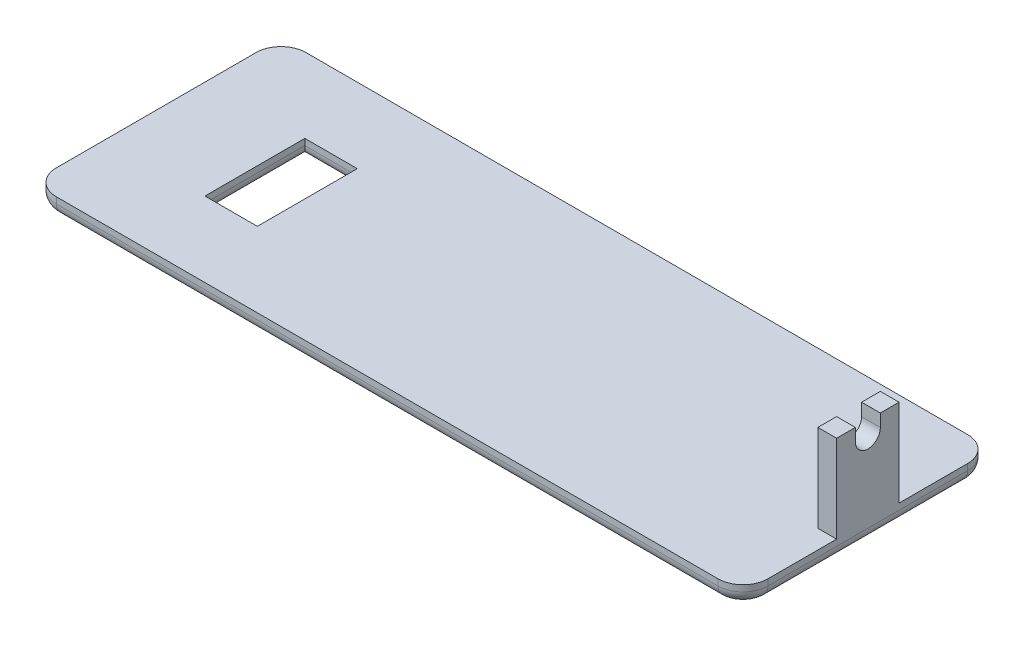
ISO-10303-21;
HEADER;
FILE_DESCRIPTION(('STEP AP214'),'2;1');
FILE_NAME('part.step','',(''),(''),'','','');
FILE_SCHEMA(('AUTOMOTIVE_DESIGN { 1 0 10303 214 1 1 1 1 }'));
ENDSEC;
DATA;
#1=APPLICATION_CONTEXT('core data for automotive mechanical design processes');
#2=APPLICATION_PROTOCOL_DEFINITION('international standard','automotive_design',2000,#1);
#3=PRODUCT_CONTEXT('',#1,'mechanical');
#4=PRODUCT('Part','Part','',(#3));
#5=PRODUCT_RELATED_PRODUCT_CATEGORY('part','',(#4));
#6=PRODUCT_DEFINITION_FORMATION('','',#4);
#7=PRODUCT_DEFINITION_CONTEXT('part definition',#1,'design');
#8=PRODUCT_DEFINITION('design','',#6,#7);
#9=PRODUCT_DEFINITION_SHAPE('','',#8);
#10=(LENGTH_UNIT() NAMED_UNIT(*) SI_UNIT(.MILLI.,.METRE.));
#11=(NAMED_UNIT(*) PLANE_ANGLE_UNIT() SI_UNIT($,.RADIAN.));
#12=(NAMED_UNIT(*) SI_UNIT($,.STERADIAN.) SOLID_ANGLE_UNIT());
#13=UNCERTAINTY_MEASURE_WITH_UNIT(LENGTH_MEASURE(1.E-05),#10,'distance_accuracy_value','');
#14=(GEOMETRIC_REPRESENTATION_CONTEXT(3) GLOBAL_UNCERTAINTY_ASSIGNED_CONTEXT((#13)) GLOBAL_UNIT_ASSIGNED_CONTEXT((#10,
#11,#12)) REPRESENTATION_CONTEXT('',''));
#15=CARTESIAN_POINT('',(0.,0.,0.));
#16=DIRECTION('',(0.,0.,1.));
#17=DIRECTION('',(1.,0.,0.));
#18=AXIS2_PLACEMENT_3D('',#15,#16,#17);
#19=CARTESIAN_POINT('',(0.,21.59,0.));
#20=DIRECTION('',(0.,-1.,0.));
#21=DIRECTION('',(0.,0.,-1.));
#22=AXIS2_PLACEMENT_3D('',#19,#20,#21);
#23=PLANE('',#22);
#24=DIRECTION('',(0.,0.,-1.));
#25=VECTOR('',#24,1.);
#26=CARTESIAN_POINT('',(72.39,21.59,-6.35000000000002));
#27=LINE('',#26,#25);
#28=CARTESIAN_POINT('',(72.39,21.59,6.34999999999998));
#29=VERTEX_POINT('',#28);
#30=CARTESIAN_POINT('',(72.39,21.59,2.54));
#31=VERTEX_POINT('',#30);
#32=EDGE_CURVE('E265',#29,#31,#27,.T.);
#33=ORIENTED_EDGE('',*,*,#32,.T.);
#34=DIRECTION('',(1.,0.,0.));
#35=VECTOR('',#34,1.);
#36=CARTESIAN_POINT('',(-72.391,21.59,2.54));
#37=LINE('',#36,#35);
#38=CARTESIAN_POINT('',(68.58,21.59,2.54));
#39=VERTEX_POINT('',#38);
#40=EDGE_CURVE('E253',#39,#31,#37,.T.);
#41=ORIENTED_EDGE('',*,*,#40,.F.);
#42=DIRECTION('',(0.,0.,1.));
#43=VECTOR('',#42,1.);
#44=CARTESIAN_POINT('',(68.58,21.59,-6.35000000000002));
#45=LINE('',#44,#43);
#46=CARTESIAN_POINT('',(68.58,21.59,6.34999999999998));
#47=VERTEX_POINT('',#46);
#48=EDGE_CURVE('E271',#39,#47,#45,.T.);
#49=ORIENTED_EDGE('',*,*,#48,.T.);
#50=DIRECTION('',(1.,0.,0.));
#51=VECTOR('',#50,1.);
#52=CARTESIAN_POINT('',(72.39,21.59,6.34999999999998));
#53=LINE('',#52,#51);
#54=EDGE_CURVE('E275',#47,#29,#53,.T.);
#55=ORIENTED_EDGE('',*,*,#54,.T.);
#56=EDGE_LOOP('',(#33,#41,#49,#55));
#57=FACE_BOUND('',#56,.T.);
#58=ADVANCED_FACE('F41',(#57),#23,.F.);
#59=CARTESIAN_POINT('',(0.,3.81,0.));
#60=DIRECTION('',(0.,-1.,0.));
#61=DIRECTION('',(0.,0.,-1.));
#62=AXIS2_PLACEMENT_3D('',#59,#60,#61);
#63=PLANE('',#62);
#64=DIRECTION('',(-1.,0.,0.));
#65=VECTOR('',#64,1.);
#66=CARTESIAN_POINT('',(0.,3.81,10.16));
#67=LINE('',#66,#65);
#68=CARTESIAN_POINT('',(-41.642,3.81,10.16));
#69=VERTEX_POINT('',#68);
#70=CARTESIAN_POINT('',(-52.31,3.81,10.16));
#71=VERTEX_POINT('',#70);
#72=EDGE_CURVE('E234',#69,#71,#67,.T.);
#73=ORIENTED_EDGE('',*,*,#72,.T.);
#74=DIRECTION('',(0.,0.,-1.));
#75=VECTOR('',#74,1.);
#76=CARTESIAN_POINT('',(-52.31,3.81,0.));
#77=LINE('',#76,#75);
#78=CARTESIAN_POINT('',(-52.31,3.81,-10.16));
#79=VERTEX_POINT('',#78);
#80=EDGE_CURVE('E227',#71,#79,#77,.T.);
#81=ORIENTED_EDGE('',*,*,#80,.T.);
#82=DIRECTION('',(1.,0.,0.));
#83=VECTOR('',#82,1.);
#84=CARTESIAN_POINT('',(0.,3.81,-10.16));
#85=LINE('',#84,#83);
#86=CARTESIAN_POINT('',(-41.642,3.81,-10.16));
#87=VERTEX_POINT('',#86);
#88=EDGE_CURVE('E215',#79,#87,#85,.T.);
#89=ORIENTED_EDGE('',*,*,#88,.T.);
#90=DIRECTION('',(0.,0.,1.));
#91=VECTOR('',#90,1.);
#92=CARTESIAN_POINT('',(-41.642,3.81,0.));
#93=LINE('',#92,#91);
#94=EDGE_CURVE('E223',#87,#69,#93,.T.);
#95=ORIENTED_EDGE('',*,*,#94,.T.);
#96=EDGE_LOOP('',(#73,#81,#89,#95));
#97=FACE_BOUND('',#96,.T.);
#98=DIRECTION('',(-1.,0.,0.));
#99=VECTOR('',#98,1.);
#100=CARTESIAN_POINT('',(-72.39,3.81,-25.4));
#101=LINE('',#100,#99);
#102=CARTESIAN_POINT('',(67.31,3.81,-25.4));
#103=VERTEX_POINT('',#102);
#104=CARTESIAN_POINT('',(-67.31,3.81,-25.4));
#105=VERTEX_POINT('',#104);
#106=EDGE_CURVE('E300',#103,#105,#101,.T.);
#107=ORIENTED_EDGE('',*,*,#106,.T.);
#108=CARTESIAN_POINT('',(-67.31,3.81,-20.32));
#109=DIRECTION('',(0.,-1.,0.));
#110=DIRECTION('',(0.,0.,-1.));
#111=AXIS2_PLACEMENT_3D('',#108,#109,#110);
#112=CIRCLE('',#111,5.08);
#113=CARTESIAN_POINT('',(-72.39,3.81,-20.32));
#114=VERTEX_POINT('',#113);
#115=EDGE_CURVE('E325',#105,#114,#112,.F.);
#116=ORIENTED_EDGE('',*,*,#115,.T.);
#117=DIRECTION('',(0.,0.,1.));
#118=VECTOR('',#117,1.);
#119=CARTESIAN_POINT('',(-72.39,3.81,25.4));
#120=LINE('',#119,#118);
#121=CARTESIAN_POINT('',(-72.39,3.81,20.32));
#122=VERTEX_POINT('',#121);
#123=EDGE_CURVE('E303',#114,#122,#120,.T.);
#124=ORIENTED_EDGE('',*,*,#123,.T.);
#125=CARTESIAN_POINT('',(-67.31,3.81,20.32));
#126=DIRECTION('',(0.,-1.,0.));
#127=DIRECTION('',(0.,0.,-1.));
#128=AXIS2_PLACEMENT_3D('',#125,#126,#127);
#129=CIRCLE('',#128,5.08);
#130=CARTESIAN_POINT('',(-67.31,3.81,25.4));
#131=VERTEX_POINT('',#130);
#132=EDGE_CURVE('E323',#122,#131,#129,.F.);
#133=ORIENTED_EDGE('',*,*,#132,.T.);
#134=DIRECTION('',(1.,0.,0.));
#135=VECTOR('',#134,1.);
#136=CARTESIAN_POINT('',(-72.39,3.81,25.4));
#137=LINE('',#136,#135);
#138=CARTESIAN_POINT('',(67.31,3.81,25.4));
#139=VERTEX_POINT('',#138);
#140=EDGE_CURVE('E306',#131,#139,#137,.T.);
#141=ORIENTED_EDGE('',*,*,#140,.T.);
#142=CARTESIAN_POINT('',(67.31,3.81,20.32));
#143=DIRECTION('',(0.,-1.,0.));
#144=DIRECTION('',(0.,0.,-1.));
#145=AXIS2_PLACEMENT_3D('',#142,#143,#144);
#146=CIRCLE('',#145,5.08);
#147=CARTESIAN_POINT('',(72.39,3.81,20.32));
#148=VERTEX_POINT('',#147);
#149=EDGE_CURVE('E321',#139,#148,#146,.F.);
#150=ORIENTED_EDGE('',*,*,#149,.T.);
#151=DIRECTION('',(0.,0.,-1.));
#152=VECTOR('',#151,1.);
#153=CARTESIAN_POINT('',(72.39,3.81,25.4));
#154=LINE('',#153,#152);
#155=CARTESIAN_POINT('',(72.39,3.81,6.34999999999998));
#156=VERTEX_POINT('',#155);
#157=EDGE_CURVE('E298',#148,#156,#154,.T.);
#158=ORIENTED_EDGE('',*,*,#157,.T.);
#159=DIRECTION('',(1.,0.,0.));
#160=VECTOR('',#159,1.);
#161=CARTESIAN_POINT('',(72.39,3.81,6.34999999999998));
#162=LINE('',#161,#160);
#163=CARTESIAN_POINT('',(68.58,3.81,6.34999999999998));
#164=VERTEX_POINT('',#163);
#165=EDGE_CURVE('E283',#164,#156,#162,.T.);
#166=ORIENTED_EDGE('',*,*,#165,.F.);
#167=DIRECTION('',(0.,0.,1.));
#168=VECTOR('',#167,1.);
#169=CARTESIAN_POINT('',(68.58,3.81,-6.35000000000002));
#170=LINE('',#169,#168);
#171=CARTESIAN_POINT('',(68.58,3.81,-6.35000000000002));
#172=VERTEX_POINT('',#171);
#173=EDGE_CURVE('E280',#172,#164,#170,.T.);
#174=ORIENTED_EDGE('',*,*,#173,.F.);
#175=DIRECTION('',(-1.,0.,0.));
#176=VECTOR('',#175,1.);
#177=CARTESIAN_POINT('',(72.39,3.81,-6.35000000000002));
#178=LINE('',#177,#176);
#179=CARTESIAN_POINT('',(72.39,3.81,-6.35000000000002));
#180=VERTEX_POINT('',#179);
#181=EDGE_CURVE('E264',#180,#172,#178,.T.);
#182=ORIENTED_EDGE('',*,*,#181,.F.);
#183=CARTESIAN_POINT('',(72.39,3.81,-20.32));
#184=VERTEX_POINT('',#183);
#185=EDGE_CURVE('E297',#180,#184,#154,.T.);
#186=ORIENTED_EDGE('',*,*,#185,.T.);
#187=CARTESIAN_POINT('',(67.31,3.81,-20.32));
#188=DIRECTION('',(0.,-1.,0.));
#189=DIRECTION('',(0.,0.,-1.));
#190=AXIS2_PLACEMENT_3D('',#187,#188,#189);
#191=CIRCLE('',#190,5.08);
#192=EDGE_CURVE('E319',#184,#103,#191,.F.);
#193=ORIENTED_EDGE('',*,*,#192,.T.);
#194=EDGE_LOOP('',(#107,#116,#124,#133,#141,#150,#158,#166,#174,#182,#186,#193));
#195=FACE_BOUND('',#194,.T.);
#196=ADVANCED_FACE('F232',(#97,#195),#63,.F.);
#197=CARTESIAN_POINT('',(72.39,3.81,25.4));
#198=DIRECTION('',(-1.,0.,0.));
#199=DIRECTION('',(0.,0.,1.));
#200=AXIS2_PLACEMENT_3D('',#197,#198,#199);
#201=PLANE('',#200);
#202=DIRECTION('',(0.,-1.,0.));
#203=VECTOR('',#202,1.);
#204=CARTESIAN_POINT('',(72.39,3.81,20.32));
#205=LINE('',#204,#203);
#206=CARTESIAN_POINT('',(72.39,2.54,20.32));
#207=VERTEX_POINT('',#206);
#208=EDGE_CURVE('E334',#148,#207,#205,.T.);
#209=ORIENTED_EDGE('',*,*,#208,.T.);
#210=DIRECTION('',(0.,0.,-1.));
#211=VECTOR('',#210,1.);
#212=CARTESIAN_POINT('',(72.39,2.54,-20.32));
#213=LINE('',#212,#211);
#214=CARTESIAN_POINT('',(72.39,2.54,-20.32));
#215=VERTEX_POINT('',#214);
#216=EDGE_CURVE('E372',#207,#215,#213,.T.);
#217=ORIENTED_EDGE('',*,*,#216,.T.);
#218=DIRECTION('',(0.,-1.,0.));
#219=VECTOR('',#218,1.);
#220=CARTESIAN_POINT('',(72.39,3.81,-20.32));
#221=LINE('',#220,#219);
#222=EDGE_CURVE('E332',#215,#184,#221,.F.);
#223=ORIENTED_EDGE('',*,*,#222,.T.);
#224=ORIENTED_EDGE('',*,*,#185,.F.);
#225=DIRECTION('',(0.,-1.,0.));
#226=VECTOR('',#225,1.);
#227=CARTESIAN_POINT('',(72.39,21.59,-6.35000000000002));
#228=LINE('',#227,#226);
#229=CARTESIAN_POINT('',(72.39,21.59,-6.35000000000002));
#230=VERTEX_POINT('',#229);
#231=EDGE_CURVE('E294',#230,#180,#228,.T.);
#232=ORIENTED_EDGE('',*,*,#231,.F.);
#233=CARTESIAN_POINT('',(72.39,21.59,-2.54));
#234=VERTEX_POINT('',#233);
#235=EDGE_CURVE('E269',#234,#230,#27,.T.);
#236=ORIENTED_EDGE('',*,*,#235,.F.);
#237=DIRECTION('',(0.,1.,0.));
#238=VECTOR('',#237,1.);
#239=CARTESIAN_POINT('',(72.39,21.59,-2.54));
#240=LINE('',#239,#238);
#241=CARTESIAN_POINT('',(72.39,19.05,-2.54));
#242=VERTEX_POINT('',#241);
#243=EDGE_CURVE('E250',#242,#234,#240,.T.);
#244=ORIENTED_EDGE('',*,*,#243,.F.);
#245=CARTESIAN_POINT('',(72.39,19.05,0.));
#246=DIRECTION('',(1.,0.,0.));
#247=DIRECTION('',(0.,0.,1.));
#248=AXIS2_PLACEMENT_3D('',#245,#246,#247);
#249=CIRCLE('',#248,2.54);
#250=CARTESIAN_POINT('',(72.39,19.05,2.54));
#251=VERTEX_POINT('',#250);
#252=EDGE_CURVE('E247',#251,#242,#249,.T.);
#253=ORIENTED_EDGE('',*,*,#252,.F.);
#254=DIRECTION('',(0.,-1.,0.));
#255=VECTOR('',#254,1.);
#256=CARTESIAN_POINT('',(72.39,21.59,2.54));
#257=LINE('',#256,#255);
#258=EDGE_CURVE('E244',#31,#251,#257,.T.);
#259=ORIENTED_EDGE('',*,*,#258,.F.);
#260=ORIENTED_EDGE('',*,*,#32,.F.);
#261=DIRECTION('',(0.,-1.,0.));
#262=VECTOR('',#261,1.);
#263=CARTESIAN_POINT('',(72.39,21.59,6.34999999999998));
#264=LINE('',#263,#262);
#265=EDGE_CURVE('E277',#29,#156,#264,.T.);
#266=ORIENTED_EDGE('',*,*,#265,.T.);
#267=ORIENTED_EDGE('',*,*,#157,.F.);
#268=EDGE_LOOP('',(#209,#217,#223,#224,#232,#236,#244,#253,#259,#260,#266,#267));
#269=FACE_BOUND('',#268,.T.);
#270=ADVANCED_FACE('F459',(#269),#201,.F.);
#271=CARTESIAN_POINT('',(-72.39,3.81,-25.4));
#272=DIRECTION('',(0.,0.,1.));
#273=DIRECTION('',(1.,0.,0.));
#274=AXIS2_PLACEMENT_3D('',#271,#272,#273);
#275=PLANE('',#274);
#276=DIRECTION('',(0.,-1.,0.));
#277=VECTOR('',#276,1.);
#278=CARTESIAN_POINT('',(67.31,3.81,-25.4));
#279=LINE('',#278,#277);
#280=CARTESIAN_POINT('',(67.31,2.54,-25.4));
#281=VERTEX_POINT('',#280);
#282=EDGE_CURVE('E314',#103,#281,#279,.T.);
#283=ORIENTED_EDGE('',*,*,#282,.T.);
#284=DIRECTION('',(-1.,0.,0.));
#285=VECTOR('',#284,1.);
#286=CARTESIAN_POINT('',(-67.31,2.54,-25.4));
#287=LINE('',#286,#285);
#288=CARTESIAN_POINT('',(-67.31,2.54,-25.4));
#289=VERTEX_POINT('',#288);
#290=EDGE_CURVE('E376',#281,#289,#287,.T.);
#291=ORIENTED_EDGE('',*,*,#290,.T.);
#292=DIRECTION('',(0.,-1.,0.));
#293=VECTOR('',#292,1.);
#294=CARTESIAN_POINT('',(-67.31,3.81,-25.4));
#295=LINE('',#294,#293);
#296=EDGE_CURVE('E317',#289,#105,#295,.F.);
#297=ORIENTED_EDGE('',*,*,#296,.T.);
#298=ORIENTED_EDGE('',*,*,#106,.F.);
#299=EDGE_LOOP('',(#283,#291,#297,#298));
#300=FACE_BOUND('',#299,.T.);
#301=ADVANCED_FACE('F518',(#300),#275,.F.);
#302=CARTESIAN_POINT('',(-72.39,3.81,25.4));
#303=DIRECTION('',(1.,0.,0.));
#304=DIRECTION('',(0.,0.,-1.));
#305=AXIS2_PLACEMENT_3D('',#302,#303,#304);
#306=PLANE('',#305);
#307=DIRECTION('',(0.,-1.,0.));
#308=VECTOR('',#307,1.);
#309=CARTESIAN_POINT('',(-72.39,3.81,-20.32));
#310=LINE('',#309,#308);
#311=CARTESIAN_POINT('',(-72.39,2.54,-20.32));
#312=VERTEX_POINT('',#311);
#313=EDGE_CURVE('E311',#114,#312,#310,.T.);
#314=ORIENTED_EDGE('',*,*,#313,.T.);
#315=DIRECTION('',(0.,0.,1.));
#316=VECTOR('',#315,1.);
#317=CARTESIAN_POINT('',(-72.39,2.54,20.32));
#318=LINE('',#317,#316);
#319=CARTESIAN_POINT('',(-72.39,2.54,20.32));
#320=VERTEX_POINT('',#319);
#321=EDGE_CURVE('E337',#312,#320,#318,.T.);
#322=ORIENTED_EDGE('',*,*,#321,.T.);
#323=DIRECTION('',(0.,-1.,0.));
#324=VECTOR('',#323,1.);
#325=CARTESIAN_POINT('',(-72.39,3.81,20.32));
#326=LINE('',#325,#324);
#327=EDGE_CURVE('E309',#320,#122,#326,.F.);
#328=ORIENTED_EDGE('',*,*,#327,.T.);
#329=ORIENTED_EDGE('',*,*,#123,.F.);
#330=EDGE_LOOP('',(#314,#322,#328,#329));
#331=FACE_BOUND('',#330,.T.);
#332=ADVANCED_FACE('F526',(#331),#306,.F.);
#333=CARTESIAN_POINT('',(-72.39,3.81,25.4));
#334=DIRECTION('',(0.,0.,-1.));
#335=DIRECTION('',(-1.,0.,0.));
#336=AXIS2_PLACEMENT_3D('',#333,#334,#335);
#337=PLANE('',#336);
#338=DIRECTION('',(0.,-1.,0.));
#339=VECTOR('',#338,1.);
#340=CARTESIAN_POINT('',(-67.31,3.81,25.4));
#341=LINE('',#340,#339);
#342=CARTESIAN_POINT('',(-67.31,2.54,25.4));
#343=VERTEX_POINT('',#342);
#344=EDGE_CURVE('E329',#131,#343,#341,.T.);
#345=ORIENTED_EDGE('',*,*,#344,.T.);
#346=DIRECTION('',(1.,0.,0.));
#347=VECTOR('',#346,1.);
#348=CARTESIAN_POINT('',(67.31,2.54,25.4));
#349=LINE('',#348,#347);
#350=CARTESIAN_POINT('',(67.31,2.54,25.4));
#351=VERTEX_POINT('',#350);
#352=EDGE_CURVE('E368',#343,#351,#349,.T.);
#353=ORIENTED_EDGE('',*,*,#352,.T.);
#354=DIRECTION('',(0.,-1.,0.));
#355=VECTOR('',#354,1.);
#356=CARTESIAN_POINT('',(67.31,3.81,25.4));
#357=LINE('',#356,#355);
#358=EDGE_CURVE('E327',#351,#139,#357,.F.);
#359=ORIENTED_EDGE('',*,*,#358,.T.);
#360=ORIENTED_EDGE('',*,*,#140,.F.);
#361=EDGE_LOOP('',(#345,#353,#359,#360));
#362=FACE_BOUND('',#361,.T.);
#363=ADVANCED_FACE('F537',(#362),#337,.F.);
#364=CARTESIAN_POINT('',(0.,0.,0.));
#365=DIRECTION('',(0.,-1.,0.));
#366=DIRECTION('',(0.,0.,-1.));
#367=AXIS2_PLACEMENT_3D('',#364,#365,#366);
#368=PLANE('',#367);
#369=DIRECTION('',(0.,0.,-1.));
#370=VECTOR('',#369,1.);
#371=CARTESIAN_POINT('',(-54.85,0.,10.16));
#372=LINE('',#371,#370);
#373=CARTESIAN_POINT('',(-54.85,0.,-12.7));
#374=VERTEX_POINT('',#373);
#375=CARTESIAN_POINT('',(-54.85,0.,12.7));
#376=VERTEX_POINT('',#375);
#377=EDGE_CURVE('E361',#374,#376,#372,.F.);
#378=ORIENTED_EDGE('',*,*,#377,.T.);
#379=DIRECTION('',(-1.,0.,0.));
#380=VECTOR('',#379,1.);
#381=CARTESIAN_POINT('',(-41.642,0.,12.7));
#382=LINE('',#381,#380);
#383=CARTESIAN_POINT('',(-39.102,0.,12.7));
#384=VERTEX_POINT('',#383);
#385=EDGE_CURVE('E363',#376,#384,#382,.F.);
#386=ORIENTED_EDGE('',*,*,#385,.T.);
#387=DIRECTION('',(0.,0.,1.));
#388=VECTOR('',#387,1.);
#389=CARTESIAN_POINT('',(-39.102,0.,-10.16));
#390=LINE('',#389,#388);
#391=CARTESIAN_POINT('',(-39.102,0.,-12.7));
#392=VERTEX_POINT('',#391);
#393=EDGE_CURVE('E357',#384,#392,#390,.F.);
#394=ORIENTED_EDGE('',*,*,#393,.T.);
#395=DIRECTION('',(1.,0.,0.));
#396=VECTOR('',#395,1.);
#397=CARTESIAN_POINT('',(-52.31,0.,-12.7));
#398=LINE('',#397,#396);
#399=EDGE_CURVE('E359',#392,#374,#398,.F.);
#400=ORIENTED_EDGE('',*,*,#399,.T.);
#401=EDGE_LOOP('',(#378,#386,#394,#400));
#402=FACE_BOUND('',#401,.T.);
#403=CARTESIAN_POINT('',(-67.31,0.,20.32));
#404=DIRECTION('',(0.,-1.,0.));
#405=DIRECTION('',(0.,0.,-1.));
#406=AXIS2_PLACEMENT_3D('',#403,#404,#405);
#407=CIRCLE('',#406,2.54);
#408=CARTESIAN_POINT('',(-67.31,0.,22.86));
#409=VERTEX_POINT('',#408);
#410=CARTESIAN_POINT('',(-69.85,0.,20.32));
#411=VERTEX_POINT('',#410);
#412=EDGE_CURVE('E352',#409,#411,#407,.T.);
#413=ORIENTED_EDGE('',*,*,#412,.T.);
#414=DIRECTION('',(0.,0.,1.));
#415=VECTOR('',#414,1.);
#416=CARTESIAN_POINT('',(-69.85,0.,-20.32));
#417=LINE('',#416,#415);
#418=CARTESIAN_POINT('',(-69.85,0.,-20.32));
#419=VERTEX_POINT('',#418);
#420=EDGE_CURVE('E354',#411,#419,#417,.F.);
#421=ORIENTED_EDGE('',*,*,#420,.T.);
#422=CARTESIAN_POINT('',(-67.31,0.,-20.32));
#423=DIRECTION('',(0.,-1.,0.));
#424=DIRECTION('',(0.,0.,-1.));
#425=AXIS2_PLACEMENT_3D('',#422,#423,#424);
#426=CIRCLE('',#425,2.54);
#427=CARTESIAN_POINT('',(-67.31,0.,-22.86));
#428=VERTEX_POINT('',#427);
#429=EDGE_CURVE('E340',#419,#428,#426,.T.);
#430=ORIENTED_EDGE('',*,*,#429,.T.);
#431=DIRECTION('',(-1.,0.,0.));
#432=VECTOR('',#431,1.);
#433=CARTESIAN_POINT('',(67.31,0.,-22.86));
#434=LINE('',#433,#432);
#435=CARTESIAN_POINT('',(67.31,0.,-22.86));
#436=VERTEX_POINT('',#435);
#437=EDGE_CURVE('E342',#428,#436,#434,.F.);
#438=ORIENTED_EDGE('',*,*,#437,.T.);
#439=CARTESIAN_POINT('',(67.31,0.,-20.32));
#440=DIRECTION('',(0.,-1.,0.));
#441=DIRECTION('',(0.,0.,-1.));
#442=AXIS2_PLACEMENT_3D('',#439,#440,#441);
#443=CIRCLE('',#442,2.54);
#444=CARTESIAN_POINT('',(69.85,0.,-20.32));
#445=VERTEX_POINT('',#444);
#446=EDGE_CURVE('E344',#436,#445,#443,.T.);
#447=ORIENTED_EDGE('',*,*,#446,.T.);
#448=DIRECTION('',(0.,0.,-1.));
#449=VECTOR('',#448,1.);
#450=CARTESIAN_POINT('',(69.85,0.,20.32));
#451=LINE('',#450,#449);
#452=CARTESIAN_POINT('',(69.85,0.,20.32));
#453=VERTEX_POINT('',#452);
#454=EDGE_CURVE('E346',#445,#453,#451,.F.);
#455=ORIENTED_EDGE('',*,*,#454,.T.);
#456=CARTESIAN_POINT('',(67.31,0.,20.32));
#457=DIRECTION('',(0.,-1.,0.));
#458=DIRECTION('',(0.,0.,-1.));
#459=AXIS2_PLACEMENT_3D('',#456,#457,#458);
#460=CIRCLE('',#459,2.54);
#461=CARTESIAN_POINT('',(67.31,0.,22.86));
#462=VERTEX_POINT('',#461);
#463=EDGE_CURVE('E348',#453,#462,#460,.T.);
#464=ORIENTED_EDGE('',*,*,#463,.T.);
#465=DIRECTION('',(1.,0.,0.));
#466=VECTOR('',#465,1.);
#467=CARTESIAN_POINT('',(-67.31,0.,22.86));
#468=LINE('',#467,#466);
#469=EDGE_CURVE('E350',#462,#409,#468,.F.);
#470=ORIENTED_EDGE('',*,*,#469,.T.);
#471=EDGE_LOOP('',(#413,#421,#430,#438,#447,#455,#464,#470));
#472=FACE_BOUND('',#471,.T.);
#473=ADVANCED_FACE('F423',(#402,#472),#368,.T.);
#474=CARTESIAN_POINT('',(72.39,21.59,-6.35000000000002));
#475=DIRECTION('',(0.,0.,1.));
#476=DIRECTION('',(1.,0.,0.));
#477=AXIS2_PLACEMENT_3D('',#474,#475,#476);
#478=PLANE('',#477);
#479=ORIENTED_EDGE('',*,*,#181,.T.);
#480=DIRECTION('',(0.,-1.,0.));
#481=VECTOR('',#480,1.);
#482=CARTESIAN_POINT('',(68.58,21.59,-6.35000000000002));
#483=LINE('',#482,#481);
#484=CARTESIAN_POINT('',(68.58,21.59,-6.35000000000002));
#485=VERTEX_POINT('',#484);
#486=EDGE_CURVE('E291',#485,#172,#483,.T.);
#487=ORIENTED_EDGE('',*,*,#486,.F.);
#488=DIRECTION('',(-1.,0.,0.));
#489=VECTOR('',#488,1.);
#490=CARTESIAN_POINT('',(72.39,21.59,-6.35000000000002));
#491=LINE('',#490,#489);
#492=EDGE_CURVE('E268',#230,#485,#491,.T.);
#493=ORIENTED_EDGE('',*,*,#492,.F.);
#494=ORIENTED_EDGE('',*,*,#231,.T.);
#495=EDGE_LOOP('',(#479,#487,#493,#494));
#496=FACE_BOUND('',#495,.T.);
#497=ADVANCED_FACE('F492',(#496),#478,.F.);
#498=CARTESIAN_POINT('',(68.58,21.59,-6.35000000000002));
#499=DIRECTION('',(1.,0.,0.));
#500=DIRECTION('',(0.,0.,-1.));
#501=AXIS2_PLACEMENT_3D('',#498,#499,#500);
#502=PLANE('',#501);
#503=ORIENTED_EDGE('',*,*,#48,.F.);
#504=DIRECTION('',(0.,1.,0.));
#505=VECTOR('',#504,1.);
#506=CARTESIAN_POINT('',(68.58,21.59,2.54));
#507=LINE('',#506,#505);
#508=CARTESIAN_POINT('',(68.58,19.05,2.54));
#509=VERTEX_POINT('',#508);
#510=EDGE_CURVE('E238',#509,#39,#507,.T.);
#511=ORIENTED_EDGE('',*,*,#510,.F.);
#512=CARTESIAN_POINT('',(68.58,19.05,0.));
#513=DIRECTION('',(1.,0.,0.));
#514=DIRECTION('',(0.,0.,-1.));
#515=AXIS2_PLACEMENT_3D('',#512,#513,#514);
#516=CIRCLE('',#515,2.54);
#517=CARTESIAN_POINT('',(68.58,19.05,-2.54));
#518=VERTEX_POINT('',#517);
#519=EDGE_CURVE('E255',#518,#509,#516,.F.);
#520=ORIENTED_EDGE('',*,*,#519,.F.);
#521=DIRECTION('',(0.,-1.,0.));
#522=VECTOR('',#521,1.);
#523=CARTESIAN_POINT('',(68.58,21.59,-2.54));
#524=LINE('',#523,#522);
#525=CARTESIAN_POINT('',(68.58,21.59,-2.54));
#526=VERTEX_POINT('',#525);
#527=EDGE_CURVE('E235',#526,#518,#524,.T.);
#528=ORIENTED_EDGE('',*,*,#527,.F.);
#529=EDGE_CURVE('E272',#485,#526,#45,.T.);
#530=ORIENTED_EDGE('',*,*,#529,.F.);
#531=ORIENTED_EDGE('',*,*,#486,.T.);
#532=ORIENTED_EDGE('',*,*,#173,.T.);
#533=DIRECTION('',(0.,-1.,0.));
#534=VECTOR('',#533,1.);
#535=CARTESIAN_POINT('',(68.58,21.59,6.34999999999998));
#536=LINE('',#535,#534);
#537=EDGE_CURVE('E288',#47,#164,#536,.T.);
#538=ORIENTED_EDGE('',*,*,#537,.F.);
#539=EDGE_LOOP('',(#503,#511,#520,#528,#530,#531,#532,#538));
#540=FACE_BOUND('',#539,.T.);
#541=ADVANCED_FACE('F473',(#540),#502,.F.);
#542=CARTESIAN_POINT('',(72.39,21.59,6.34999999999998));
#543=DIRECTION('',(0.,0.,-1.));
#544=DIRECTION('',(-1.,0.,0.));
#545=AXIS2_PLACEMENT_3D('',#542,#543,#544);
#546=PLANE('',#545);
#547=ORIENTED_EDGE('',*,*,#165,.T.);
#548=ORIENTED_EDGE('',*,*,#265,.F.);
#549=ORIENTED_EDGE('',*,*,#54,.F.);
#550=ORIENTED_EDGE('',*,*,#537,.T.);
#551=EDGE_LOOP('',(#547,#548,#549,#550));
#552=FACE_BOUND('',#551,.T.);
#553=ADVANCED_FACE('F465',(#552),#546,.F.);
#554=ORIENTED_EDGE('',*,*,#529,.T.);
#555=DIRECTION('',(1.,0.,0.));
#556=VECTOR('',#555,1.);
#557=CARTESIAN_POINT('',(-72.391,21.59,-2.54));
#558=LINE('',#557,#556);
#559=EDGE_CURVE('E256',#526,#234,#558,.T.);
#560=ORIENTED_EDGE('',*,*,#559,.T.);
#561=ORIENTED_EDGE('',*,*,#235,.T.);
#562=ORIENTED_EDGE('',*,*,#492,.T.);
#563=EDGE_LOOP('',(#554,#560,#561,#562));
#564=FACE_BOUND('',#563,.T.);
#565=ADVANCED_FACE('F453',(#564),#23,.F.);
#566=CARTESIAN_POINT('',(-72.391,21.59,2.54));
#567=DIRECTION('',(0.,0.,1.));
#568=DIRECTION('',(0.,-1.,0.));
#569=AXIS2_PLACEMENT_3D('',#566,#567,#568);
#570=PLANE('',#569);
#571=ORIENTED_EDGE('',*,*,#510,.T.);
#572=ORIENTED_EDGE('',*,*,#40,.T.);
#573=ORIENTED_EDGE('',*,*,#258,.T.);
#574=DIRECTION('',(1.,0.,0.));
#575=VECTOR('',#574,1.);
#576=CARTESIAN_POINT('',(-72.391,19.05,2.54));
#577=LINE('',#576,#575);
#578=EDGE_CURVE('E252',#509,#251,#577,.T.);
#579=ORIENTED_EDGE('',*,*,#578,.F.);
#580=EDGE_LOOP('',(#571,#572,#573,#579));
#581=FACE_BOUND('',#580,.T.);
#582=ADVANCED_FACE('F464',(#581),#570,.F.);
#583=CARTESIAN_POINT('',(-72.391,21.59,-2.54));
#584=DIRECTION('',(0.,0.,-1.));
#585=DIRECTION('',(-1.,0.,0.));
#586=AXIS2_PLACEMENT_3D('',#583,#584,#585);
#587=PLANE('',#586);
#588=ORIENTED_EDGE('',*,*,#527,.T.);
#589=DIRECTION('',(1.,0.,0.));
#590=VECTOR('',#589,1.);
#591=CARTESIAN_POINT('',(-72.391,19.05,-2.54));
#592=LINE('',#591,#590);
#593=EDGE_CURVE('E259',#518,#242,#592,.T.);
#594=ORIENTED_EDGE('',*,*,#593,.T.);
#595=ORIENTED_EDGE('',*,*,#243,.T.);
#596=ORIENTED_EDGE('',*,*,#559,.F.);
#597=EDGE_LOOP('',(#588,#594,#595,#596));
#598=FACE_BOUND('',#597,.T.);
#599=ADVANCED_FACE('F471',(#598),#587,.F.);
#600=CARTESIAN_POINT('',(-72.391,19.05,0.));
#601=DIRECTION('',(1.,0.,0.));
#602=DIRECTION('',(0.,0.,-1.));
#603=AXIS2_PLACEMENT_3D('',#600,#601,#602);
#604=CYLINDRICAL_SURFACE('',#603,2.54);
#605=ORIENTED_EDGE('',*,*,#519,.T.);
#606=ORIENTED_EDGE('',*,*,#578,.T.);
#607=ORIENTED_EDGE('',*,*,#252,.T.);
#608=ORIENTED_EDGE('',*,*,#593,.F.);
#609=EDGE_LOOP('',(#605,#606,#607,#608));
#610=FACE_BOUND('',#609,.T.);
#611=ADVANCED_FACE('F695',(#610),#604,.F.);
#612=CARTESIAN_POINT('',(-52.31,21.59,-10.16));
#613=DIRECTION('',(-1.,0.,0.));
#614=DIRECTION('',(0.,0.,1.));
#615=AXIS2_PLACEMENT_3D('',#612,#613,#614);
#616=PLANE('',#615);
#617=DIRECTION('',(0.,-1.,0.));
#618=VECTOR('',#617,1.);
#619=CARTESIAN_POINT('',(-52.31,21.59,10.16));
#620=LINE('',#619,#618);
#621=CARTESIAN_POINT('',(-52.31,2.54,10.16));
#622=VERTEX_POINT('',#621);
#623=EDGE_CURVE('E224',#71,#622,#620,.T.);
#624=ORIENTED_EDGE('',*,*,#623,.T.);
#625=DIRECTION('',(0.,0.,-1.));
#626=VECTOR('',#625,1.);
#627=CARTESIAN_POINT('',(-52.31,2.54,-10.16));
#628=LINE('',#627,#626);
#629=CARTESIAN_POINT('',(-52.31,2.54,-10.16));
#630=VERTEX_POINT('',#629);
#631=EDGE_CURVE('E66',#622,#630,#628,.T.);
#632=ORIENTED_EDGE('',*,*,#631,.T.);
#633=DIRECTION('',(0.,-1.,0.));
#634=VECTOR('',#633,1.);
#635=CARTESIAN_POINT('',(-52.31,21.59,-10.16));
#636=LINE('',#635,#634);
#637=EDGE_CURVE('E217',#79,#630,#636,.T.);
#638=ORIENTED_EDGE('',*,*,#637,.F.);
#639=ORIENTED_EDGE('',*,*,#80,.F.);
#640=EDGE_LOOP('',(#624,#632,#638,#639));
#641=FACE_BOUND('',#640,.T.);
#642=ADVANCED_FACE('F226',(#641),#616,.F.);
#643=CARTESIAN_POINT('',(-41.642,21.59,10.16));
#644=DIRECTION('',(0.,0.,1.));
#645=DIRECTION('',(1.,0.,0.));
#646=AXIS2_PLACEMENT_3D('',#643,#644,#645);
#647=PLANE('',#646);
#648=DIRECTION('',(0.,-1.,0.));
#649=VECTOR('',#648,1.);
#650=CARTESIAN_POINT('',(-41.642,21.59,10.16));
#651=LINE('',#650,#649);
#652=CARTESIAN_POINT('',(-41.642,2.54,10.16));
#653=VERTEX_POINT('',#652);
#654=EDGE_CURVE('E435',#69,#653,#651,.T.);
#655=ORIENTED_EDGE('',*,*,#654,.T.);
#656=DIRECTION('',(-1.,0.,0.));
#657=VECTOR('',#656,1.);
#658=CARTESIAN_POINT('',(-52.31,2.54,10.16));
#659=LINE('',#658,#657);
#660=EDGE_CURVE('E378',#653,#622,#659,.T.);
#661=ORIENTED_EDGE('',*,*,#660,.T.);
#662=ORIENTED_EDGE('',*,*,#623,.F.);
#663=ORIENTED_EDGE('',*,*,#72,.F.);
#664=EDGE_LOOP('',(#655,#661,#662,#663));
#665=FACE_BOUND('',#664,.T.);
#666=ADVANCED_FACE('F433',(#665),#647,.F.);
#667=CARTESIAN_POINT('',(-41.642,21.59,-10.16));
#668=DIRECTION('',(1.,0.,0.));
#669=DIRECTION('',(0.,0.,-1.));
#670=AXIS2_PLACEMENT_3D('',#667,#668,#669);
#671=PLANE('',#670);
#672=DIRECTION('',(0.,-1.,0.));
#673=VECTOR('',#672,1.);
#674=CARTESIAN_POINT('',(-41.642,21.59,-10.16));
#675=LINE('',#674,#673);
#676=CARTESIAN_POINT('',(-41.642,2.54,-10.16));
#677=VERTEX_POINT('',#676);
#678=EDGE_CURVE('E218',#87,#677,#675,.T.);
#679=ORIENTED_EDGE('',*,*,#678,.T.);
#680=DIRECTION('',(0.,0.,1.));
#681=VECTOR('',#680,1.);
#682=CARTESIAN_POINT('',(-41.642,2.54,10.16));
#683=LINE('',#682,#681);
#684=EDGE_CURVE('E50',#677,#653,#683,.T.);
#685=ORIENTED_EDGE('',*,*,#684,.T.);
#686=ORIENTED_EDGE('',*,*,#654,.F.);
#687=ORIENTED_EDGE('',*,*,#94,.F.);
#688=EDGE_LOOP('',(#679,#685,#686,#687));
#689=FACE_BOUND('',#688,.T.);
#690=ADVANCED_FACE('F440',(#689),#671,.F.);
#691=CARTESIAN_POINT('',(-41.642,21.59,-10.16));
#692=DIRECTION('',(0.,0.,-1.));
#693=DIRECTION('',(-1.,0.,0.));
#694=AXIS2_PLACEMENT_3D('',#691,#692,#693);
#695=PLANE('',#694);
#696=ORIENTED_EDGE('',*,*,#637,.T.);
#697=DIRECTION('',(1.,0.,0.));
#698=VECTOR('',#697,1.);
#699=CARTESIAN_POINT('',(-41.642,2.54,-10.16));
#700=LINE('',#699,#698);
#701=EDGE_CURVE('E58',#630,#677,#700,.T.);
#702=ORIENTED_EDGE('',*,*,#701,.T.);
#703=ORIENTED_EDGE('',*,*,#678,.F.);
#704=ORIENTED_EDGE('',*,*,#88,.F.);
#705=EDGE_LOOP('',(#696,#702,#703,#704));
#706=FACE_BOUND('',#705,.T.);
#707=ADVANCED_FACE('F216',(#706),#695,.F.);
#708=CARTESIAN_POINT('',(-67.31,3.81,-20.32));
#709=DIRECTION('',(0.,-1.,0.));
#710=DIRECTION('',(0.,0.,-1.));
#711=AXIS2_PLACEMENT_3D('',#708,#709,#710);
#712=CYLINDRICAL_SURFACE('',#711,5.08);
#713=ORIENTED_EDGE('',*,*,#296,.F.);
#714=CARTESIAN_POINT('',(-67.31,2.54,-20.32));
#715=DIRECTION('',(0.,-1.,0.));
#716=DIRECTION('',(0.,0.,-1.));
#717=AXIS2_PLACEMENT_3D('',#714,#715,#716);
#718=CIRCLE('',#717,5.08);
#719=EDGE_CURVE('E11',#289,#312,#718,.F.);
#720=ORIENTED_EDGE('',*,*,#719,.T.);
#721=ORIENTED_EDGE('',*,*,#313,.F.);
#722=ORIENTED_EDGE('',*,*,#115,.F.);
#723=EDGE_LOOP('',(#713,#720,#721,#722));
#724=FACE_BOUND('',#723,.T.);
#725=ADVANCED_FACE('F447',(#724),#712,.T.);
#726=CARTESIAN_POINT('',(-67.31,3.81,20.32));
#727=DIRECTION('',(0.,-1.,0.));
#728=DIRECTION('',(0.,0.,-1.));
#729=AXIS2_PLACEMENT_3D('',#726,#727,#728);
#730=CYLINDRICAL_SURFACE('',#729,5.08);
#731=ORIENTED_EDGE('',*,*,#327,.F.);
#732=CARTESIAN_POINT('',(-67.31,2.54,20.32));
#733=DIRECTION('',(0.,-1.,0.));
#734=DIRECTION('',(0.,0.,-1.));
#735=AXIS2_PLACEMENT_3D('',#732,#733,#734);
#736=CIRCLE('',#735,5.08);
#737=EDGE_CURVE('E366',#320,#343,#736,.F.);
#738=ORIENTED_EDGE('',*,*,#737,.T.);
#739=ORIENTED_EDGE('',*,*,#344,.F.);
#740=ORIENTED_EDGE('',*,*,#132,.F.);
#741=EDGE_LOOP('',(#731,#738,#739,#740));
#742=FACE_BOUND('',#741,.T.);
#743=ADVANCED_FACE('F531',(#742),#730,.T.);
#744=CARTESIAN_POINT('',(67.31,3.81,20.32));
#745=DIRECTION('',(0.,-1.,0.));
#746=DIRECTION('',(0.,0.,-1.));
#747=AXIS2_PLACEMENT_3D('',#744,#745,#746);
#748=CYLINDRICAL_SURFACE('',#747,5.08);
#749=ORIENTED_EDGE('',*,*,#358,.F.);
#750=CARTESIAN_POINT('',(67.31,2.54,20.32));
#751=DIRECTION('',(0.,-1.,0.));
#752=DIRECTION('',(0.,0.,-1.));
#753=AXIS2_PLACEMENT_3D('',#750,#751,#752);
#754=CIRCLE('',#753,5.08);
#755=EDGE_CURVE('E370',#351,#207,#754,.F.);
#756=ORIENTED_EDGE('',*,*,#755,.T.);
#757=ORIENTED_EDGE('',*,*,#208,.F.);
#758=ORIENTED_EDGE('',*,*,#149,.F.);
#759=EDGE_LOOP('',(#749,#756,#757,#758));
#760=FACE_BOUND('',#759,.T.);
#761=ADVANCED_FACE('F542',(#760),#748,.T.);
#762=CARTESIAN_POINT('',(67.31,3.81,-20.32));
#763=DIRECTION('',(0.,-1.,0.));
#764=DIRECTION('',(0.,0.,-1.));
#765=AXIS2_PLACEMENT_3D('',#762,#763,#764);
#766=CYLINDRICAL_SURFACE('',#765,5.08);
#767=ORIENTED_EDGE('',*,*,#222,.F.);
#768=CARTESIAN_POINT('',(67.31,2.54,-20.32));
#769=DIRECTION('',(0.,-1.,0.));
#770=DIRECTION('',(0.,0.,-1.));
#771=AXIS2_PLACEMENT_3D('',#768,#769,#770);
#772=CIRCLE('',#771,5.08);
#773=EDGE_CURVE('E374',#215,#281,#772,.F.);
#774=ORIENTED_EDGE('',*,*,#773,.T.);
#775=ORIENTED_EDGE('',*,*,#282,.F.);
#776=ORIENTED_EDGE('',*,*,#192,.F.);
#777=EDGE_LOOP('',(#767,#774,#775,#776));
#778=FACE_BOUND('',#777,.T.);
#779=ADVANCED_FACE('F499',(#778),#766,.T.);
#780=CARTESIAN_POINT('',(69.85,2.54,25.4));
#781=DIRECTION('',(0.,0.,1.));
#782=DIRECTION('',(1.,0.,0.));
#783=AXIS2_PLACEMENT_3D('',#780,#781,#782);
#784=CYLINDRICAL_SURFACE('',#783,2.54);
#785=CARTESIAN_POINT('',(69.85,2.54,20.32));
#786=DIRECTION('',(0.,0.,1.));
#787=DIRECTION('',(1.,0.,0.));
#788=AXIS2_PLACEMENT_3D('',#785,#786,#787);
#789=CIRCLE('',#788,2.54);
#790=EDGE_CURVE('E400',#453,#207,#789,.T.);
#791=ORIENTED_EDGE('',*,*,#790,.F.);
#792=ORIENTED_EDGE('',*,*,#454,.F.);
#793=CARTESIAN_POINT('',(69.85,2.54,-20.32));
#794=DIRECTION('',(0.,0.,-1.));
#795=DIRECTION('',(-1.,0.,0.));
#796=AXIS2_PLACEMENT_3D('',#793,#794,#795);
#797=CIRCLE('',#796,2.54);
#798=EDGE_CURVE('E229',#215,#445,#797,.T.);
#799=ORIENTED_EDGE('',*,*,#798,.F.);
#800=ORIENTED_EDGE('',*,*,#216,.F.);
#801=EDGE_LOOP('',(#791,#792,#799,#800));
#802=FACE_BOUND('',#801,.T.);
#803=ADVANCED_FACE('F505',(#802),#784,.T.);
#804=CARTESIAN_POINT('',(67.31,2.54,-20.32));
#805=DIRECTION('',(0.,-1.,0.));
#806=DIRECTION('',(0.,0.,-1.));
#807=AXIS2_PLACEMENT_3D('',#804,#805,#806);
#808=DEGENERATE_TOROIDAL_SURFACE('',#807,2.54,2.54,.T.);
#809=ORIENTED_EDGE('',*,*,#798,.T.);
#810=ORIENTED_EDGE('',*,*,#446,.F.);
#811=CARTESIAN_POINT('',(67.31,2.54,-22.86));
#812=DIRECTION('',(-1.,0.,0.));
#813=DIRECTION('',(0.,0.,1.));
#814=AXIS2_PLACEMENT_3D('',#811,#812,#813);
#815=CIRCLE('',#814,2.54);
#816=EDGE_CURVE('E397',#281,#436,#815,.T.);
#817=ORIENTED_EDGE('',*,*,#816,.F.);
#818=ORIENTED_EDGE('',*,*,#773,.F.);
#819=EDGE_LOOP('',(#809,#810,#817,#818));
#820=FACE_BOUND('',#819,.T.);
#821=ADVANCED_FACE('F509',(#820),#808,.T.);
#822=CARTESIAN_POINT('',(67.31,2.54,20.32));
#823=DIRECTION('',(0.,-1.,0.));
#824=DIRECTION('',(0.,0.,-1.));
#825=AXIS2_PLACEMENT_3D('',#822,#823,#824);
#826=DEGENERATE_TOROIDAL_SURFACE('',#825,2.54,2.54,.T.);
#827=ORIENTED_EDGE('',*,*,#790,.T.);
#828=ORIENTED_EDGE('',*,*,#755,.F.);
#829=CARTESIAN_POINT('',(67.31,2.54,22.86));
#830=DIRECTION('',(-1.,0.,0.));
#831=DIRECTION('',(0.,0.,1.));
#832=AXIS2_PLACEMENT_3D('',#829,#830,#831);
#833=CIRCLE('',#832,2.54);
#834=EDGE_CURVE('E394',#462,#351,#833,.T.);
#835=ORIENTED_EDGE('',*,*,#834,.F.);
#836=ORIENTED_EDGE('',*,*,#463,.F.);
#837=EDGE_LOOP('',(#827,#828,#835,#836));
#838=FACE_BOUND('',#837,.T.);
#839=ADVANCED_FACE('F546',(#838),#826,.T.);
#840=CARTESIAN_POINT('',(-72.39,2.54,-22.86));
#841=DIRECTION('',(1.,0.,0.));
#842=DIRECTION('',(0.,0.,-1.));
#843=AXIS2_PLACEMENT_3D('',#840,#841,#842);
#844=CYLINDRICAL_SURFACE('',#843,2.54);
#845=ORIENTED_EDGE('',*,*,#816,.T.);
#846=ORIENTED_EDGE('',*,*,#437,.F.);
#847=CARTESIAN_POINT('',(-67.31,2.54,-22.86));
#848=DIRECTION('',(-1.,0.,0.));
#849=DIRECTION('',(0.,0.,1.));
#850=AXIS2_PLACEMENT_3D('',#847,#848,#849);
#851=CIRCLE('',#850,2.54);
#852=EDGE_CURVE('E391',#289,#428,#851,.T.);
#853=ORIENTED_EDGE('',*,*,#852,.F.);
#854=ORIENTED_EDGE('',*,*,#290,.F.);
#855=EDGE_LOOP('',(#845,#846,#853,#854));
#856=FACE_BOUND('',#855,.T.);
#857=ADVANCED_FACE('F514',(#856),#844,.T.);
#858=CARTESIAN_POINT('',(-72.39,2.54,22.86));
#859=DIRECTION('',(-1.,0.,0.));
#860=DIRECTION('',(0.,0.,1.));
#861=AXIS2_PLACEMENT_3D('',#858,#859,#860);
#862=CYLINDRICAL_SURFACE('',#861,2.54);
#863=ORIENTED_EDGE('',*,*,#834,.T.);
#864=ORIENTED_EDGE('',*,*,#352,.F.);
#865=CARTESIAN_POINT('',(-67.31,2.54,22.86));
#866=DIRECTION('',(-1.,0.,0.));
#867=DIRECTION('',(0.,0.,1.));
#868=AXIS2_PLACEMENT_3D('',#865,#866,#867);
#869=CIRCLE('',#868,2.54);
#870=EDGE_CURVE('E388',#409,#343,#869,.T.);
#871=ORIENTED_EDGE('',*,*,#870,.F.);
#872=ORIENTED_EDGE('',*,*,#469,.F.);
#873=EDGE_LOOP('',(#863,#864,#871,#872));
#874=FACE_BOUND('',#873,.T.);
#875=ADVANCED_FACE('F550',(#874),#862,.T.);
#876=CARTESIAN_POINT('',(-67.31,2.54,-20.32));
#877=DIRECTION('',(0.,-1.,0.));
#878=DIRECTION('',(0.,0.,-1.));
#879=AXIS2_PLACEMENT_3D('',#876,#877,#878);
#880=DEGENERATE_TOROIDAL_SURFACE('',#879,2.54,2.54,.T.);
#881=ORIENTED_EDGE('',*,*,#852,.T.);
#882=ORIENTED_EDGE('',*,*,#429,.F.);
#883=CARTESIAN_POINT('',(-69.85,2.54,-20.32));
#884=DIRECTION('',(0.,0.,1.));
#885=DIRECTION('',(1.,0.,0.));
#886=AXIS2_PLACEMENT_3D('',#883,#884,#885);
#887=CIRCLE('',#886,2.54);
#888=EDGE_CURVE('E386',#312,#419,#887,.T.);
#889=ORIENTED_EDGE('',*,*,#888,.F.);
#890=ORIENTED_EDGE('',*,*,#719,.F.);
#891=EDGE_LOOP('',(#881,#882,#889,#890));
#892=FACE_BOUND('',#891,.T.);
#893=ADVANCED_FACE('F556',(#892),#880,.T.);
#894=CARTESIAN_POINT('',(-67.31,2.54,20.32));
#895=DIRECTION('',(0.,-1.,0.));
#896=DIRECTION('',(0.,0.,-1.));
#897=AXIS2_PLACEMENT_3D('',#894,#895,#896);
#898=DEGENERATE_TOROIDAL_SURFACE('',#897,2.54,2.54,.T.);
#899=ORIENTED_EDGE('',*,*,#870,.T.);
#900=ORIENTED_EDGE('',*,*,#737,.F.);
#901=CARTESIAN_POINT('',(-69.85,2.54,20.32));
#902=DIRECTION('',(0.,0.,-1.));
#903=DIRECTION('',(-1.,0.,0.));
#904=AXIS2_PLACEMENT_3D('',#901,#902,#903);
#905=CIRCLE('',#904,2.54);
#906=EDGE_CURVE('E384',#411,#320,#905,.T.);
#907=ORIENTED_EDGE('',*,*,#906,.F.);
#908=ORIENTED_EDGE('',*,*,#412,.F.);
#909=EDGE_LOOP('',(#899,#900,#907,#908));
#910=FACE_BOUND('',#909,.T.);
#911=ADVANCED_FACE('F561',(#910),#898,.T.);
#912=CARTESIAN_POINT('',(-69.85,2.54,25.4));
#913=DIRECTION('',(0.,0.,-1.));
#914=DIRECTION('',(-1.,0.,0.));
#915=AXIS2_PLACEMENT_3D('',#912,#913,#914);
#916=CYLINDRICAL_SURFACE('',#915,2.54);
#917=ORIENTED_EDGE('',*,*,#888,.T.);
#918=ORIENTED_EDGE('',*,*,#420,.F.);
#919=ORIENTED_EDGE('',*,*,#906,.T.);
#920=ORIENTED_EDGE('',*,*,#321,.F.);
#921=EDGE_LOOP('',(#917,#918,#919,#920));
#922=FACE_BOUND('',#921,.T.);
#923=ADVANCED_FACE('F558',(#922),#916,.T.);
#924=CARTESIAN_POINT('',(-41.642,2.54,-12.7));
#925=DIRECTION('',(-1.,0.,0.));
#926=DIRECTION('',(0.,0.,1.));
#927=AXIS2_PLACEMENT_3D('',#924,#925,#926);
#928=CYLINDRICAL_SURFACE('',#927,2.54);
#929=CARTESIAN_POINT('',(-54.85,2.54,-12.7));
#930=DIRECTION('',(-0.707106781186547,0.,0.707106781186548));
#931=DIRECTION('',(0.707106781186548,0.,0.707106781186547));
#932=AXIS2_PLACEMENT_3D('',#929,#930,#931);
#933=ELLIPSE('',#932,3.59210244842766,2.54);
#934=EDGE_CURVE('E408',#374,#630,#933,.T.);
#935=ORIENTED_EDGE('',*,*,#934,.F.);
#936=ORIENTED_EDGE('',*,*,#399,.F.);
#937=CARTESIAN_POINT('',(-39.102,2.54,-12.7));
#938=DIRECTION('',(-0.707106781186547,0.,-0.707106781186547));
#939=DIRECTION('',(-0.707106781186547,0.,0.707106781186547));
#940=AXIS2_PLACEMENT_3D('',#937,#938,#939);
#941=ELLIPSE('',#940,3.59210244842766,2.54);
#942=EDGE_CURVE('E45',#677,#392,#941,.F.);
#943=ORIENTED_EDGE('',*,*,#942,.F.);
#944=ORIENTED_EDGE('',*,*,#701,.F.);
#945=EDGE_LOOP('',(#935,#936,#943,#944));
#946=FACE_BOUND('',#945,.T.);
#947=ADVANCED_FACE('F43',(#946),#928,.T.);
#948=CARTESIAN_POINT('',(-39.102,2.54,-10.16));
#949=DIRECTION('',(0.,0.,-1.));
#950=DIRECTION('',(-1.,0.,0.));
#951=AXIS2_PLACEMENT_3D('',#948,#949,#950);
#952=CYLINDRICAL_SURFACE('',#951,2.54);
#953=ORIENTED_EDGE('',*,*,#942,.T.);
#954=ORIENTED_EDGE('',*,*,#393,.F.);
#955=CARTESIAN_POINT('',(-39.102,2.54,12.7));
#956=DIRECTION('',(0.707106781186547,0.,-0.707106781186547));
#957=DIRECTION('',(0.707106781186547,0.,0.707106781186547));
#958=AXIS2_PLACEMENT_3D('',#955,#956,#957);
#959=ELLIPSE('',#958,3.59210244842766,2.54);
#960=EDGE_CURVE('E407',#653,#384,#959,.F.);
#961=ORIENTED_EDGE('',*,*,#960,.F.);
#962=ORIENTED_EDGE('',*,*,#684,.F.);
#963=EDGE_LOOP('',(#953,#954,#961,#962));
#964=FACE_BOUND('',#963,.T.);
#965=ADVANCED_FACE('F418',(#964),#952,.T.);
#966=CARTESIAN_POINT('',(-54.85,2.54,-10.16));
#967=DIRECTION('',(0.,0.,1.));
#968=DIRECTION('',(1.,0.,0.));
#969=AXIS2_PLACEMENT_3D('',#966,#967,#968);
#970=CYLINDRICAL_SURFACE('',#969,2.54);
#971=ORIENTED_EDGE('',*,*,#934,.T.);
#972=ORIENTED_EDGE('',*,*,#631,.F.);
#973=CARTESIAN_POINT('',(-54.85,2.54,12.7));
#974=DIRECTION('',(0.707106781186548,0.,0.707106781186547));
#975=DIRECTION('',(0.707106781186547,0.,-0.707106781186548));
#976=AXIS2_PLACEMENT_3D('',#973,#974,#975);
#977=ELLIPSE('',#976,3.59210244842766,2.54);
#978=EDGE_CURVE('E405',#376,#622,#977,.T.);
#979=ORIENTED_EDGE('',*,*,#978,.F.);
#980=ORIENTED_EDGE('',*,*,#377,.F.);
#981=EDGE_LOOP('',(#971,#972,#979,#980));
#982=FACE_BOUND('',#981,.T.);
#983=ADVANCED_FACE('F430',(#982),#970,.T.);
#984=CARTESIAN_POINT('',(-41.642,2.54,12.7));
#985=DIRECTION('',(1.,0.,0.));
#986=DIRECTION('',(0.,0.,-1.));
#987=AXIS2_PLACEMENT_3D('',#984,#985,#986);
#988=CYLINDRICAL_SURFACE('',#987,2.54);
#989=ORIENTED_EDGE('',*,*,#960,.T.);
#990=ORIENTED_EDGE('',*,*,#385,.F.);
#991=ORIENTED_EDGE('',*,*,#978,.T.);
#992=ORIENTED_EDGE('',*,*,#660,.F.);
#993=EDGE_LOOP('',(#989,#990,#991,#992));
#994=FACE_BOUND('',#993,.T.);
#995=ADVANCED_FACE('F428',(#994),#988,.T.);
#996=CLOSED_SHELL('',(#58,#196,#270,#301,#332,#363,#473,#497,#541,#553,#565,#582,#599,#611,#642,
#666,#690,#707,#725,#743,#761,#779,#803,#821,#839,#857,#875,#893,#911,#923,#947,#965,#983,#995));
#997=MANIFOLD_SOLID_BREP('B2',#996);
#998=ADVANCED_BREP_SHAPE_REPRESENTATION('',(#18,#997),#14);
#999=SHAPE_DEFINITION_REPRESENTATION(#9,#998);
ENDSEC;
END-ISO-10303-21;
